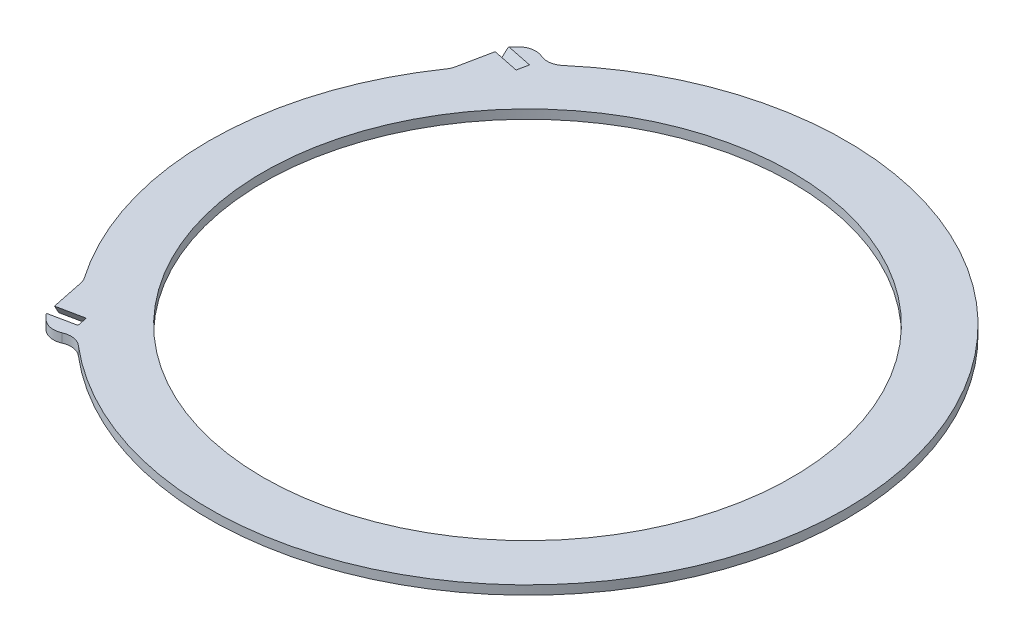
ISO-10303-21;
HEADER;
FILE_DESCRIPTION(('STEP AP214'),'2;1');
FILE_NAME('part.step','',(''),(''),'','','');
FILE_SCHEMA(('AUTOMOTIVE_DESIGN { 1 0 10303 214 1 1 1 1 }'));
ENDSEC;
DATA;
#1=APPLICATION_CONTEXT('core data for automotive mechanical design processes');
#2=APPLICATION_PROTOCOL_DEFINITION('international standard','automotive_design',2000,#1);
#3=PRODUCT_CONTEXT('',#1,'mechanical');
#4=PRODUCT('Part','Part','',(#3));
#5=PRODUCT_RELATED_PRODUCT_CATEGORY('part','',(#4));
#6=PRODUCT_DEFINITION_FORMATION('','',#4);
#7=PRODUCT_DEFINITION_CONTEXT('part definition',#1,'design');
#8=PRODUCT_DEFINITION('design','',#6,#7);
#9=PRODUCT_DEFINITION_SHAPE('','',#8);
#10=(LENGTH_UNIT() NAMED_UNIT(*) SI_UNIT(.MILLI.,.METRE.));
#11=(NAMED_UNIT(*) PLANE_ANGLE_UNIT() SI_UNIT($,.RADIAN.));
#12=(NAMED_UNIT(*) SI_UNIT($,.STERADIAN.) SOLID_ANGLE_UNIT());
#13=UNCERTAINTY_MEASURE_WITH_UNIT(LENGTH_MEASURE(1.E-05),#10,'distance_accuracy_value','');
#14=(GEOMETRIC_REPRESENTATION_CONTEXT(3) GLOBAL_UNCERTAINTY_ASSIGNED_CONTEXT((#13)) GLOBAL_UNIT_ASSIGNED_CONTEXT((#10,
#11,#12)) REPRESENTATION_CONTEXT('',''));
#15=CARTESIAN_POINT('',(0.,0.,0.));
#16=DIRECTION('',(0.,0.,1.));
#17=DIRECTION('',(1.,0.,0.));
#18=AXIS2_PLACEMENT_3D('',#15,#16,#17);
#19=CARTESIAN_POINT('',(0.,10.,0.));
#20=DIRECTION('',(0.,1.,0.));
#21=DIRECTION('',(0.,0.,1.));
#22=AXIS2_PLACEMENT_3D('',#19,#20,#21);
#23=PLANE('',#22);
#24=CARTESIAN_POINT('',(0.,10.,0.));
#25=DIRECTION('',(0.,1.,0.));
#26=DIRECTION('',(0.,0.,1.));
#27=AXIS2_PLACEMENT_3D('',#24,#25,#26);
#28=CIRCLE('',#27,295.);
#29=CARTESIAN_POINT('',(0.,10.,295.));
#30=VERTEX_POINT('',#29);
#31=EDGE_CURVE('E249',#30,#30,#28,.T.);
#32=ORIENTED_EDGE('',*,*,#31,.F.);
#33=EDGE_LOOP('',(#32));
#34=FACE_BOUND('',#33,.T.);
#35=CARTESIAN_POINT('',(0.,10.,0.));
#36=DIRECTION('',(0.,-1.,0.));
#37=DIRECTION('',(0.,0.,-1.));
#38=AXIS2_PLACEMENT_3D('',#35,#36,#37);
#39=CIRCLE('',#38,380.);
#40=CARTESIAN_POINT('',(-278.828900011322,10.,-258.175220574082));
#41=VERTEX_POINT('',#40);
#42=CARTESIAN_POINT('',(-274.342282872324,10.,-262.937847843178));
#43=VERTEX_POINT('',#42);
#44=EDGE_CURVE('E191',#41,#43,#39,.T.);
#45=ORIENTED_EDGE('',*,*,#44,.F.);
#46=DIRECTION('',(0.979540105481506,0.,0.201249054043192));
#47=VECTOR('',#46,1.);
#48=CARTESIAN_POINT('',(39.6015736039974,10.,-192.752854266674));
#49=LINE('',#48,#47);
#50=CARTESIAN_POINT('',(-250.00650002847,9.99999999999995,-252.253583778055));
#51=VERTEX_POINT('',#50);
#52=EDGE_CURVE('E315',#41,#51,#49,.T.);
#53=ORIENTED_EDGE('',*,*,#52,.T.);
#54=DIRECTION('',(0.201249054043193,0.,-0.979540105481506));
#55=VECTOR('',#54,1.);
#56=CARTESIAN_POINT('',(-289.608073632468,10.,-59.5007295113819));
#57=LINE('',#56,#55);
#58=CARTESIAN_POINT('',(-252.564496303329,10.,-239.803041077076));
#59=VERTEX_POINT('',#58);
#60=EDGE_CURVE('E183',#59,#51,#57,.T.);
#61=ORIENTED_EDGE('',*,*,#60,.F.);
#62=DIRECTION('',(0.979540105481506,0.,0.201249054043192));
#63=VECTOR('',#62,1.);
#64=CARTESIAN_POINT('',(37.0435773291386,10.,-180.302311565694));
#65=LINE('',#64,#63);
#66=CARTESIAN_POINT('',(-281.950699467774,10.0000000000001,-245.840512698371));
#67=VERTEX_POINT('',#66);
#68=EDGE_CURVE('E169',#67,#59,#65,.T.);
#69=ORIENTED_EDGE('',*,*,#68,.F.);
#70=DIRECTION('',(0.201249054043189,0.,-0.979540105481507));
#71=VECTOR('',#70,1.);
#72=CARTESIAN_POINT('',(-281.950699467775,10.,-245.84051269837));
#73=LINE('',#72,#71);
#74=CARTESIAN_POINT('',(-289.47071954455,10.,-209.238297128964));
#75=VERTEX_POINT('',#74);
#76=EDGE_CURVE('E181',#75,#67,#73,.T.);
#77=ORIENTED_EDGE('',*,*,#76,.F.);
#78=CARTESIAN_POINT('',(-309.061521654181,10.,-213.263278209828));
#79=DIRECTION('',(0.,1.,0.));
#80=DIRECTION('',(0.,0.,1.));
#81=AXIS2_PLACEMENT_3D('',#78,#79,#80);
#82=CIRCLE('',#81,20.);
#83=CARTESIAN_POINT('',(-292.600188942906,10.,-201.904381900383));
#84=VERTEX_POINT('',#83);
#85=EDGE_CURVE('E296',#75,#84,#82,.F.);
#86=ORIENTED_EDGE('',*,*,#85,.T.);
#87=CARTESIAN_POINT('',(0.,10.,0.));
#88=DIRECTION('',(0.,1.,0.));
#89=DIRECTION('',(0.,0.,1.));
#90=AXIS2_PLACEMENT_3D('',#87,#88,#89);
#91=CIRCLE('',#90,355.5);
#92=CARTESIAN_POINT('',(-292.600188942906,10.,201.904381900383));
#93=VERTEX_POINT('',#92);
#94=EDGE_CURVE('E259',#84,#93,#91,.T.);
#95=ORIENTED_EDGE('',*,*,#94,.T.);
#96=CARTESIAN_POINT('',(-309.061521654181,10.,213.263278209828));
#97=DIRECTION('',(0.,1.,0.));
#98=DIRECTION('',(0.,0.,1.));
#99=AXIS2_PLACEMENT_3D('',#96,#97,#98);
#100=CIRCLE('',#99,20.);
#101=CARTESIAN_POINT('',(-289.47071954455,10.,209.238297128964));
#102=VERTEX_POINT('',#101);
#103=EDGE_CURVE('E271',#93,#102,#100,.F.);
#104=ORIENTED_EDGE('',*,*,#103,.T.);
#105=DIRECTION('',(0.201249054043189,0.,0.979540105481507));
#106=VECTOR('',#105,1.);
#107=CARTESIAN_POINT('',(-279.584698805436,10.,257.356554596679));
#108=LINE('',#107,#106);
#109=CARTESIAN_POINT('',(-281.950699467775,10.,245.84051269837));
#110=VERTEX_POINT('',#109);
#111=EDGE_CURVE('E229',#102,#110,#108,.T.);
#112=ORIENTED_EDGE('',*,*,#111,.T.);
#113=DIRECTION('',(0.979540105481506,0.,-0.201249054043191));
#114=VECTOR('',#113,1.);
#115=CARTESIAN_POINT('',(37.0435773291383,10.,180.302311565693));
#116=LINE('',#115,#114);
#117=CARTESIAN_POINT('',(-252.564496303331,10.,239.803041077075));
#118=VERTEX_POINT('',#117);
#119=EDGE_CURVE('E219',#110,#118,#116,.T.);
#120=ORIENTED_EDGE('',*,*,#119,.T.);
#121=DIRECTION('',(-0.201249054043302,0.,-0.979540105481484));
#122=VECTOR('',#121,1.);
#123=CARTESIAN_POINT('',(-289.608073632483,10.,59.5007295114184));
#124=LINE('',#123,#122);
#125=CARTESIAN_POINT('',(-250.198495640991,9.99999999999866,251.319082975383));
#126=VERTEX_POINT('',#125);
#127=EDGE_CURVE('E222',#126,#118,#124,.T.);
#128=ORIENTED_EDGE('',*,*,#127,.F.);
#129=DIRECTION('',(-0.979540105481501,0.,0.201249054043218));
#130=VECTOR('',#129,1.);
#131=CARTESIAN_POINT('',(-250.198495640991,9.99999999999866,251.319082975383));
#132=LINE('',#131,#130);
#133=CARTESIAN_POINT('',(-279.584698805436,9.99999999999993,257.356554596679));
#134=VERTEX_POINT('',#133);
#135=EDGE_CURVE('E211',#126,#134,#132,.T.);
#136=ORIENTED_EDGE('',*,*,#135,.T.);
#137=CARTESIAN_POINT('',(0.,10.,0.));
#138=DIRECTION('',(0.,1.,0.));
#139=DIRECTION('',(0.,0.,1.));
#140=AXIS2_PLACEMENT_3D('',#137,#138,#139);
#141=CIRCLE('',#140,380.);
#142=CARTESIAN_POINT('',(-274.342282872324,10.,262.937847843178));
#143=VERTEX_POINT('',#142);
#144=EDGE_CURVE('E224',#134,#143,#141,.T.);
#145=ORIENTED_EDGE('',*,*,#144,.T.);
#146=CARTESIAN_POINT('',(-259.903215352728,10.,249.099013746168));
#147=DIRECTION('',(0.,1.,0.));
#148=DIRECTION('',(0.,0.,1.));
#149=AXIS2_PLACEMENT_3D('',#146,#147,#148);
#150=CIRCLE('',#149,19.9999999999999);
#151=CARTESIAN_POINT('',(-251.803676827684,10.,267.38555184613));
#152=VERTEX_POINT('',#151);
#153=EDGE_CURVE('E239',#143,#152,#150,.T.);
#154=ORIENTED_EDGE('',*,*,#153,.T.);
#155=CARTESIAN_POINT('',(-243.70413830264,10.,285.672089946091));
#156=DIRECTION('',(0.,1.,0.));
#157=DIRECTION('',(0.,0.,1.));
#158=AXIS2_PLACEMENT_3D('',#155,#156,#157);
#159=CIRCLE('',#158,20.);
#160=CARTESIAN_POINT('',(-230.723891255895,10.,270.456532558816));
#161=VERTEX_POINT('',#160);
#162=EDGE_CURVE('E278',#152,#161,#159,.F.);
#163=ORIENTED_EDGE('',*,*,#162,.T.);
#164=CARTESIAN_POINT('',(-230.723891255895,10.,-270.456532558816));
#165=VERTEX_POINT('',#164);
#166=EDGE_CURVE('E255',#161,#165,#91,.T.);
#167=ORIENTED_EDGE('',*,*,#166,.T.);
#168=CARTESIAN_POINT('',(-243.704138302641,10.,-285.672089946091));
#169=DIRECTION('',(0.,1.,0.));
#170=DIRECTION('',(0.,0.,1.));
#171=AXIS2_PLACEMENT_3D('',#168,#169,#170);
#172=CIRCLE('',#171,20.);
#173=CARTESIAN_POINT('',(-251.803676827684,10.,-267.38555184613));
#174=VERTEX_POINT('',#173);
#175=EDGE_CURVE('E175',#165,#174,#172,.F.);
#176=ORIENTED_EDGE('',*,*,#175,.T.);
#177=CARTESIAN_POINT('',(-259.903215352728,10.,-249.099013746168));
#178=DIRECTION('',(0.,-1.,0.));
#179=DIRECTION('',(0.,0.,-1.));
#180=AXIS2_PLACEMENT_3D('',#177,#178,#179);
#181=CIRCLE('',#180,19.9999999999999);
#182=EDGE_CURVE('E190',#43,#174,#181,.T.);
#183=ORIENTED_EDGE('',*,*,#182,.F.);
#184=EDGE_LOOP('',(#45,#53,#61,#69,#77,#86,#95,#104,#112,#120,#128,#136,#145,#154,#163,#167,
#176,#183));
#185=FACE_BOUND('',#184,.T.);
#186=ADVANCED_FACE('F33',(#34,#185),#23,.T.);
#187=CARTESIAN_POINT('',(0.,0.,0.));
#188=DIRECTION('',(0.,1.,0.));
#189=DIRECTION('',(0.,0.,1.));
#190=AXIS2_PLACEMENT_3D('',#187,#188,#189);
#191=PLANE('',#190);
#192=CARTESIAN_POINT('',(0.,0.,0.));
#193=DIRECTION('',(0.,1.,0.));
#194=DIRECTION('',(0.,0.,1.));
#195=AXIS2_PLACEMENT_3D('',#192,#193,#194);
#196=CIRCLE('',#195,295.);
#197=CARTESIAN_POINT('',(0.,0.,295.));
#198=VERTEX_POINT('',#197);
#199=EDGE_CURVE('E247',#198,#198,#196,.T.);
#200=ORIENTED_EDGE('',*,*,#199,.T.);
#201=EDGE_LOOP('',(#200));
#202=FACE_BOUND('',#201,.T.);
#203=DIRECTION('',(0.979540105481506,0.,0.201249054043192));
#204=VECTOR('',#203,1.);
#205=CARTESIAN_POINT('',(38.0225781110135,0.,-185.067404915839));
#206=LINE('',#205,#204);
#207=CARTESIAN_POINT('',(-280.9716986859,0.,-250.605606048516));
#208=VERTEX_POINT('',#207);
#209=CARTESIAN_POINT('',(-251.585495521454,0.,-244.568134427221));
#210=VERTEX_POINT('',#209);
#211=EDGE_CURVE('E306',#208,#210,#206,.T.);
#212=ORIENTED_EDGE('',*,*,#211,.F.);
#213=DIRECTION('',(0.201249054043189,0.,-0.979540105481507));
#214=VECTOR('',#213,1.);
#215=CARTESIAN_POINT('',(-279.584698805436,0.,-257.356554596679));
#216=LINE('',#215,#214);
#217=CARTESIAN_POINT('',(-279.584698805436,0.,-257.356554596679));
#218=VERTEX_POINT('',#217);
#219=EDGE_CURVE('E314',#208,#218,#216,.T.);
#220=ORIENTED_EDGE('',*,*,#219,.T.);
#221=CARTESIAN_POINT('',(0.,0.,0.));
#222=DIRECTION('',(0.,-1.,0.));
#223=DIRECTION('',(0.,0.,-1.));
#224=AXIS2_PLACEMENT_3D('',#221,#222,#223);
#225=CIRCLE('',#224,380.);
#226=CARTESIAN_POINT('',(-274.342282872324,0.,-262.937847843178));
#227=VERTEX_POINT('',#226);
#228=EDGE_CURVE('E194',#218,#227,#225,.T.);
#229=ORIENTED_EDGE('',*,*,#228,.T.);
#230=CARTESIAN_POINT('',(-259.903215352728,0.,-249.099013746168));
#231=DIRECTION('',(0.,-1.,0.));
#232=DIRECTION('',(0.,0.,-1.));
#233=AXIS2_PLACEMENT_3D('',#230,#231,#232);
#234=CIRCLE('',#233,19.9999999999999);
#235=CARTESIAN_POINT('',(-251.803676827684,0.,-267.38555184613));
#236=VERTEX_POINT('',#235);
#237=EDGE_CURVE('E206',#227,#236,#234,.T.);
#238=ORIENTED_EDGE('',*,*,#237,.T.);
#239=CARTESIAN_POINT('',(-243.704138302641,0.,-285.672089946091));
#240=DIRECTION('',(0.,1.,0.));
#241=DIRECTION('',(0.,0.,1.));
#242=AXIS2_PLACEMENT_3D('',#239,#240,#241);
#243=CIRCLE('',#242,20.);
#244=CARTESIAN_POINT('',(-230.723891255895,0.,-270.456532558816));
#245=VERTEX_POINT('',#244);
#246=EDGE_CURVE('E56',#236,#245,#243,.T.);
#247=ORIENTED_EDGE('',*,*,#246,.T.);
#248=CARTESIAN_POINT('',(0.,0.,0.));
#249=DIRECTION('',(0.,1.,0.));
#250=DIRECTION('',(0.,0.,1.));
#251=AXIS2_PLACEMENT_3D('',#248,#249,#250);
#252=CIRCLE('',#251,355.5);
#253=CARTESIAN_POINT('',(-230.723891255895,0.,270.456532558816));
#254=VERTEX_POINT('',#253);
#255=EDGE_CURVE('E260',#254,#245,#252,.T.);
#256=ORIENTED_EDGE('',*,*,#255,.F.);
#257=CARTESIAN_POINT('',(-243.70413830264,0.,285.672089946091));
#258=DIRECTION('',(0.,1.,0.));
#259=DIRECTION('',(0.,0.,1.));
#260=AXIS2_PLACEMENT_3D('',#257,#258,#259);
#261=CIRCLE('',#260,20.);
#262=CARTESIAN_POINT('',(-251.803676827684,0.,267.38555184613));
#263=VERTEX_POINT('',#262);
#264=EDGE_CURVE('E276',#254,#263,#261,.T.);
#265=ORIENTED_EDGE('',*,*,#264,.T.);
#266=CARTESIAN_POINT('',(-259.903215352728,0.,249.099013746168));
#267=DIRECTION('',(0.,1.,0.));
#268=DIRECTION('',(0.,0.,1.));
#269=AXIS2_PLACEMENT_3D('',#266,#267,#268);
#270=CIRCLE('',#269,19.9999999999999);
#271=CARTESIAN_POINT('',(-274.342282872324,0.,262.937847843178));
#272=VERTEX_POINT('',#271);
#273=EDGE_CURVE('E228',#272,#263,#270,.T.);
#274=ORIENTED_EDGE('',*,*,#273,.F.);
#275=CARTESIAN_POINT('',(0.,0.,0.));
#276=DIRECTION('',(0.,1.,0.));
#277=DIRECTION('',(0.,0.,1.));
#278=AXIS2_PLACEMENT_3D('',#275,#276,#277);
#279=CIRCLE('',#278,380.);
#280=CARTESIAN_POINT('',(-279.584698805436,0.,257.356554596679));
#281=VERTEX_POINT('',#280);
#282=EDGE_CURVE('E225',#281,#272,#279,.T.);
#283=ORIENTED_EDGE('',*,*,#282,.F.);
#284=DIRECTION('',(0.201249054043189,0.,0.979540105481507));
#285=VECTOR('',#284,1.);
#286=CARTESIAN_POINT('',(-281.950699467775,0.,245.84051269837));
#287=LINE('',#286,#285);
#288=CARTESIAN_POINT('',(-280.828821371287,0.,251.301033217067));
#289=VERTEX_POINT('',#288);
#290=EDGE_CURVE('E232',#289,#281,#287,.T.);
#291=ORIENTED_EDGE('',*,*,#290,.F.);
#292=DIRECTION('',(0.979540105481506,0.,-0.201249054043191));
#293=VECTOR('',#292,1.);
#294=CARTESIAN_POINT('',(38.1654554256262,0.,185.76283208439));
#295=LINE('',#294,#293);
#296=CARTESIAN_POINT('',(-251.442618206844,0.,245.263561595772));
#297=VERTEX_POINT('',#296);
#298=EDGE_CURVE('E210',#289,#297,#295,.T.);
#299=ORIENTED_EDGE('',*,*,#298,.T.);
#300=DIRECTION('',(-0.201249054043302,0.,-0.979540105481484));
#301=VECTOR('',#300,1.);
#302=CARTESIAN_POINT('',(-289.608073632484,0.,59.5007295114188));
#303=LINE('',#302,#301);
#304=CARTESIAN_POINT('',(-253.808618869184,0.,233.747519697463));
#305=VERTEX_POINT('',#304);
#306=EDGE_CURVE('E285',#297,#305,#303,.T.);
#307=ORIENTED_EDGE('',*,*,#306,.T.);
#308=DIRECTION('',(0.979540105481506,0.,-0.201249054043191));
#309=VECTOR('',#308,1.);
#310=CARTESIAN_POINT('',(35.7994547632876,0.,174.246790186081));
#311=LINE('',#310,#309);
#312=CARTESIAN_POINT('',(-283.194822033625,0.,239.784991318758));
#313=VERTEX_POINT('',#312);
#314=EDGE_CURVE('E217',#313,#305,#311,.T.);
#315=ORIENTED_EDGE('',*,*,#314,.F.);
#316=CARTESIAN_POINT('',(-289.47071954455,0.,209.238297128964));
#317=VERTEX_POINT('',#316);
#318=EDGE_CURVE('E233',#317,#313,#287,.T.);
#319=ORIENTED_EDGE('',*,*,#318,.F.);
#320=CARTESIAN_POINT('',(-309.061521654181,0.,213.263278209828));
#321=DIRECTION('',(0.,1.,0.));
#322=DIRECTION('',(0.,0.,1.));
#323=AXIS2_PLACEMENT_3D('',#320,#321,#322);
#324=CIRCLE('',#323,20.);
#325=CARTESIAN_POINT('',(-292.600188942906,0.,201.904381900383));
#326=VERTEX_POINT('',#325);
#327=EDGE_CURVE('E273',#317,#326,#324,.T.);
#328=ORIENTED_EDGE('',*,*,#327,.T.);
#329=CARTESIAN_POINT('',(-292.600188942906,0.,-201.904381900383));
#330=VERTEX_POINT('',#329);
#331=EDGE_CURVE('E252',#330,#326,#252,.T.);
#332=ORIENTED_EDGE('',*,*,#331,.F.);
#333=CARTESIAN_POINT('',(-309.061521654181,0.,-213.263278209828));
#334=DIRECTION('',(0.,1.,0.));
#335=DIRECTION('',(0.,0.,1.));
#336=AXIS2_PLACEMENT_3D('',#333,#334,#335);
#337=CIRCLE('',#336,20.);
#338=CARTESIAN_POINT('',(-289.47071954455,0.,-209.238297128964));
#339=VERTEX_POINT('',#338);
#340=EDGE_CURVE('E298',#330,#339,#337,.T.);
#341=ORIENTED_EDGE('',*,*,#340,.T.);
#342=CARTESIAN_POINT('',(-283.529694960759,0.,-238.155063347537));
#343=VERTEX_POINT('',#342);
#344=EDGE_CURVE('E319',#339,#343,#216,.T.);
#345=ORIENTED_EDGE('',*,*,#344,.T.);
#346=DIRECTION('',(0.979540105481506,0.,0.201249054043192));
#347=VECTOR('',#346,1.);
#348=CARTESIAN_POINT('',(35.4645818361547,0.,-172.61686221486));
#349=LINE('',#348,#347);
#350=CARTESIAN_POINT('',(-254.143491796313,0.,-232.117591726241));
#351=VERTEX_POINT('',#350);
#352=EDGE_CURVE('E48',#343,#351,#349,.T.);
#353=ORIENTED_EDGE('',*,*,#352,.T.);
#354=DIRECTION('',(0.201249054043193,0.,-0.979540105481506));
#355=VECTOR('',#354,1.);
#356=CARTESIAN_POINT('',(-289.608073632468,0.,-59.5007295113819));
#357=LINE('',#356,#355);
#358=EDGE_CURVE('E11',#351,#210,#357,.T.);
#359=ORIENTED_EDGE('',*,*,#358,.T.);
#360=EDGE_LOOP('',(#212,#220,#229,#238,#247,#256,#265,#274,#283,#291,#299,#307,#315,#319,#328,
#332,#341,#345,#353,#359));
#361=FACE_BOUND('',#360,.T.);
#362=ADVANCED_FACE('F312',(#202,#361),#191,.F.);
#363=CARTESIAN_POINT('',(0.,0.,0.));
#364=DIRECTION('',(0.,1.,0.));
#365=DIRECTION('',(0.,0.,1.));
#366=AXIS2_PLACEMENT_3D('',#363,#364,#365);
#367=CYLINDRICAL_SURFACE('',#366,380.);
#368=CARTESIAN_POINT('',(0.,-240.802321982309,0.));
#369=DIRECTION('',(-0.158331668233234,0.617278261310641,0.770648188830541));
#370=DIRECTION('',(0.124226666170193,0.786744906633218,-0.604648813195666));
#371=AXIS2_PLACEMENT_3D('',#368,#369,#370);
#372=ELLIPSE('',#371,615.605673838508,380.);
#373=CARTESIAN_POINT('',(-279.584698805436,8.78406484772398,-257.356554596679));
#374=VERTEX_POINT('',#373);
#375=EDGE_CURVE('E184',#41,#374,#372,.T.);
#376=ORIENTED_EDGE('',*,*,#375,.F.);
#377=ORIENTED_EDGE('',*,*,#44,.T.);
#378=DIRECTION('',(0.,1.,0.));
#379=VECTOR('',#378,1.);
#380=CARTESIAN_POINT('',(-274.342282872324,0.,-262.937847843178));
#381=LINE('',#380,#379);
#382=EDGE_CURVE('E199',#227,#43,#381,.T.);
#383=ORIENTED_EDGE('',*,*,#382,.F.);
#384=ORIENTED_EDGE('',*,*,#228,.F.);
#385=DIRECTION('',(0.,1.,0.));
#386=VECTOR('',#385,1.);
#387=CARTESIAN_POINT('',(-279.584698805436,0.,-257.356554596679));
#388=LINE('',#387,#386);
#389=EDGE_CURVE('E203',#218,#374,#388,.T.);
#390=ORIENTED_EDGE('',*,*,#389,.T.);
#391=EDGE_LOOP('',(#376,#377,#383,#384,#390));
#392=FACE_BOUND('',#391,.T.);
#393=ADVANCED_FACE('F397',(#392),#367,.T.);
#394=CARTESIAN_POINT('',(-281.950699467775,0.,-245.84051269837));
#395=DIRECTION('',(0.979540105481507,0.,0.201249054043189));
#396=DIRECTION('',(0.201249054043189,0.,-0.979540105481507));
#397=AXIS2_PLACEMENT_3D('',#394,#395,#396);
#398=PLANE('',#397);
#399=DIRECTION('',(-0.124226666170191,-0.786744906633219,0.604648813195667));
#400=VECTOR('',#399,1.);
#401=CARTESIAN_POINT('',(-281.344729754217,-2.36245809424024,-248.789950845841));
#402=LINE('',#401,#400);
#403=EDGE_CURVE('E41',#374,#208,#402,.T.);
#404=ORIENTED_EDGE('',*,*,#403,.F.);
#405=ORIENTED_EDGE('',*,*,#389,.F.);
#406=ORIENTED_EDGE('',*,*,#219,.F.);
#407=EDGE_LOOP('',(#404,#405,#406));
#408=FACE_BOUND('',#407,.T.);
#409=ADVANCED_FACE('F317',(#408),#398,.F.);
#410=CARTESIAN_POINT('',(0.,10.,0.));
#411=DIRECTION('',(0.,-1.,0.));
#412=DIRECTION('',(0.,0.,-1.));
#413=AXIS2_PLACEMENT_3D('',#410,#411,#412);
#414=CYLINDRICAL_SURFACE('',#413,355.5);
#415=ORIENTED_EDGE('',*,*,#255,.T.);
#416=DIRECTION('',(0.,-1.,0.));
#417=VECTOR('',#416,1.);
#418=CARTESIAN_POINT('',(-230.723891255895,10.,-270.456532558816));
#419=LINE('',#418,#417);
#420=EDGE_CURVE('E294',#245,#165,#419,.F.);
#421=ORIENTED_EDGE('',*,*,#420,.T.);
#422=ORIENTED_EDGE('',*,*,#166,.F.);
#423=DIRECTION('',(0.,-1.,0.));
#424=VECTOR('',#423,1.);
#425=CARTESIAN_POINT('',(-230.723891255895,10.,270.456532558816));
#426=LINE('',#425,#424);
#427=EDGE_CURVE('E258',#161,#254,#426,.T.);
#428=ORIENTED_EDGE('',*,*,#427,.T.);
#429=EDGE_LOOP('',(#415,#421,#422,#428));
#430=FACE_BOUND('',#429,.T.);
#431=ADVANCED_FACE('F333',(#430),#414,.T.);
#432=ORIENTED_EDGE('',*,*,#94,.F.);
#433=DIRECTION('',(0.,-1.,0.));
#434=VECTOR('',#433,1.);
#435=CARTESIAN_POINT('',(-292.600188942906,10.,-201.904381900383));
#436=LINE('',#435,#434);
#437=EDGE_CURVE('E289',#84,#330,#436,.T.);
#438=ORIENTED_EDGE('',*,*,#437,.T.);
#439=ORIENTED_EDGE('',*,*,#331,.T.);
#440=DIRECTION('',(0.,-1.,0.));
#441=VECTOR('',#440,1.);
#442=CARTESIAN_POINT('',(-292.600188942906,10.,201.904381900383));
#443=LINE('',#442,#441);
#444=EDGE_CURVE('E264',#326,#93,#443,.F.);
#445=ORIENTED_EDGE('',*,*,#444,.T.);
#446=EDGE_LOOP('',(#432,#438,#439,#445));
#447=FACE_BOUND('',#446,.T.);
#448=ADVANCED_FACE('F380',(#447),#414,.T.);
#449=CARTESIAN_POINT('',(-279.584698805436,0.,257.356554596679));
#450=DIRECTION('',(-0.979540105481507,0.,0.201249054043189));
#451=DIRECTION('',(0.201249054043189,0.,0.979540105481507));
#452=AXIS2_PLACEMENT_3D('',#449,#450,#451);
#453=PLANE('',#452);
#454=ORIENTED_EDGE('',*,*,#318,.T.);
#455=DIRECTION('',(0.105823507776939,0.850587479735828,0.515075066877088));
#456=VECTOR('',#455,1.);
#457=CARTESIAN_POINT('',(-282.196619569982,8.02334505491955,244.643545070365));
#458=LINE('',#457,#456);
#459=EDGE_CURVE('E282',#313,#110,#458,.T.);
#460=ORIENTED_EDGE('',*,*,#459,.T.);
#461=ORIENTED_EDGE('',*,*,#111,.F.);
#462=DIRECTION('',(0.,-1.,0.));
#463=VECTOR('',#462,1.);
#464=CARTESIAN_POINT('',(-289.47071954455,0.,209.238297128964));
#465=LINE('',#464,#463);
#466=EDGE_CURVE('E267',#102,#317,#465,.T.);
#467=ORIENTED_EDGE('',*,*,#466,.T.);
#468=EDGE_LOOP('',(#454,#460,#461,#467));
#469=FACE_BOUND('',#468,.T.);
#470=ADVANCED_FACE('F366',(#469),#453,.T.);
#471=CARTESIAN_POINT('',(0.,10.,0.));
#472=DIRECTION('',(0.,-1.,0.));
#473=DIRECTION('',(0.,0.,-1.));
#474=AXIS2_PLACEMENT_3D('',#471,#472,#473);
#475=CYLINDRICAL_SURFACE('',#474,295.);
#476=ORIENTED_EDGE('',*,*,#199,.F.);
#477=EDGE_LOOP('',(#476));
#478=FACE_BOUND('',#477,.T.);
#479=ORIENTED_EDGE('',*,*,#31,.T.);
#480=EDGE_LOOP('',(#479));
#481=FACE_BOUND('',#480,.T.);
#482=ADVANCED_FACE('F387',(#478,#481),#475,.F.);
#483=CARTESIAN_POINT('',(0.,0.,0.));
#484=DIRECTION('',(0.,1.,0.));
#485=DIRECTION('',(0.,0.,1.));
#486=AXIS2_PLACEMENT_3D('',#483,#484,#485);
#487=CYLINDRICAL_SURFACE('',#486,380.);
#488=ORIENTED_EDGE('',*,*,#144,.F.);
#489=DIRECTION('',(0.,1.,0.));
#490=VECTOR('',#489,1.);
#491=CARTESIAN_POINT('',(-279.584698805436,0.,257.356554596679));
#492=LINE('',#491,#490);
#493=EDGE_CURVE('E244',#281,#134,#492,.T.);
#494=ORIENTED_EDGE('',*,*,#493,.F.);
#495=ORIENTED_EDGE('',*,*,#282,.T.);
#496=DIRECTION('',(0.,1.,0.));
#497=VECTOR('',#496,1.);
#498=CARTESIAN_POINT('',(-274.342282872324,0.,262.937847843178));
#499=LINE('',#498,#497);
#500=EDGE_CURVE('E236',#272,#143,#499,.T.);
#501=ORIENTED_EDGE('',*,*,#500,.T.);
#502=EDGE_LOOP('',(#488,#494,#495,#501));
#503=FACE_BOUND('',#502,.T.);
#504=ADVANCED_FACE('F346',(#503),#487,.T.);
#505=DIRECTION('',(0.105823507776939,0.850587479735828,0.515075066877088));
#506=VECTOR('',#505,1.);
#507=CARTESIAN_POINT('',(-280.484820313204,2.76500939316637,252.975390566582));
#508=LINE('',#507,#506);
#509=EDGE_CURVE('E280',#289,#134,#508,.T.);
#510=ORIENTED_EDGE('',*,*,#509,.F.);
#511=ORIENTED_EDGE('',*,*,#290,.T.);
#512=ORIENTED_EDGE('',*,*,#493,.T.);
#513=EDGE_LOOP('',(#510,#511,#512));
#514=FACE_BOUND('',#513,.T.);
#515=ADVANCED_FACE('F351',(#514),#453,.T.);
#516=CARTESIAN_POINT('',(-259.903215352728,0.,249.099013746168));
#517=DIRECTION('',(0.,1.,0.));
#518=DIRECTION('',(0.,0.,1.));
#519=AXIS2_PLACEMENT_3D('',#516,#517,#518);
#520=CYLINDRICAL_SURFACE('',#519,19.9999999999999);
#521=ORIENTED_EDGE('',*,*,#273,.T.);
#522=DIRECTION('',(0.,1.,0.));
#523=VECTOR('',#522,1.);
#524=CARTESIAN_POINT('',(-251.803676827684,0.,267.38555184613));
#525=LINE('',#524,#523);
#526=EDGE_CURVE('E269',#263,#152,#525,.T.);
#527=ORIENTED_EDGE('',*,*,#526,.T.);
#528=ORIENTED_EDGE('',*,*,#153,.F.);
#529=ORIENTED_EDGE('',*,*,#500,.F.);
#530=EDGE_LOOP('',(#521,#527,#528,#529));
#531=FACE_BOUND('',#530,.T.);
#532=ADVANCED_FACE('F343',(#531),#520,.T.);
#533=CARTESIAN_POINT('',(-309.061521654181,10.,213.263278209828));
#534=DIRECTION('',(0.,-1.,0.));
#535=DIRECTION('',(0.,0.,-1.));
#536=AXIS2_PLACEMENT_3D('',#533,#534,#535);
#537=CYLINDRICAL_SURFACE('',#536,20.);
#538=ORIENTED_EDGE('',*,*,#327,.F.);
#539=ORIENTED_EDGE('',*,*,#466,.F.);
#540=ORIENTED_EDGE('',*,*,#103,.F.);
#541=ORIENTED_EDGE('',*,*,#444,.F.);
#542=EDGE_LOOP('',(#538,#539,#540,#541));
#543=FACE_BOUND('',#542,.T.);
#544=ADVANCED_FACE('F371',(#543),#537,.F.);
#545=CARTESIAN_POINT('',(-243.70413830264,0.,285.672089946091));
#546=DIRECTION('',(0.,1.,0.));
#547=DIRECTION('',(0.,0.,1.));
#548=AXIS2_PLACEMENT_3D('',#545,#546,#547);
#549=CYLINDRICAL_SURFACE('',#548,20.);
#550=ORIENTED_EDGE('',*,*,#162,.F.);
#551=ORIENTED_EDGE('',*,*,#526,.F.);
#552=ORIENTED_EDGE('',*,*,#264,.F.);
#553=ORIENTED_EDGE('',*,*,#427,.F.);
#554=EDGE_LOOP('',(#550,#551,#552,#553));
#555=FACE_BOUND('',#554,.T.);
#556=ADVANCED_FACE('F339',(#555),#549,.F.);
#557=CARTESIAN_POINT('',(-253.154417463623,5.25833566174585,236.931716099551));
#558=DIRECTION('',(0.979540105481484,-1.80703976088159E-13,-0.201249054043302));
#559=DIRECTION('',(-0.201249054043302,0.,-0.979540105481484));
#560=AXIS2_PLACEMENT_3D('',#557,#558,#559);
#561=PLANE('',#560);
#562=ORIENTED_EDGE('',*,*,#127,.T.);
#563=DIRECTION('',(0.105823507777147,0.850587479735828,0.515075066877045));
#564=VECTOR('',#563,1.);
#565=CARTESIAN_POINT('',(-253.154417463623,5.25833566174585,236.931716099551));
#566=LINE('',#565,#564);
#567=EDGE_CURVE('E207',#305,#118,#566,.T.);
#568=ORIENTED_EDGE('',*,*,#567,.F.);
#569=ORIENTED_EDGE('',*,*,#306,.F.);
#570=DIRECTION('',(0.105823507777149,0.850587479735829,0.515075066877044));
#571=VECTOR('',#570,1.);
#572=CARTESIAN_POINT('',(-251.442618206845,-7.31359417471822E-12,245.263561595767));
#573=LINE('',#572,#571);
#574=EDGE_CURVE('E202',#297,#126,#573,.T.);
#575=ORIENTED_EDGE('',*,*,#574,.T.);
#576=EDGE_LOOP('',(#562,#568,#569,#575));
#577=FACE_BOUND('',#576,.T.);
#578=ADVANCED_FACE('F359',(#577),#561,.F.);
#579=CARTESIAN_POINT('',(-250.198495640991,9.99999999999867,251.319082975383));
#580=DIRECTION('',(0.171179925677817,-0.525833566175318,0.833184549621682));
#581=DIRECTION('',(0.,-0.84566677340253,-0.533711259355613));
#582=AXIS2_PLACEMENT_3D('',#579,#580,#581);
#583=PLANE('',#582);
#584=ORIENTED_EDGE('',*,*,#509,.T.);
#585=ORIENTED_EDGE('',*,*,#135,.F.);
#586=ORIENTED_EDGE('',*,*,#574,.F.);
#587=ORIENTED_EDGE('',*,*,#298,.F.);
#588=EDGE_LOOP('',(#584,#585,#586,#587));
#589=FACE_BOUND('',#588,.T.);
#590=ADVANCED_FACE('F354',(#589),#583,.F.);
#591=CARTESIAN_POINT('',(-251.910294897769,15.2583356617518,242.987237479166));
#592=DIRECTION('',(0.171179925677817,-0.525833566175318,0.833184549621682));
#593=DIRECTION('',(0.,-0.84566677340253,-0.533711259355613));
#594=AXIS2_PLACEMENT_3D('',#591,#592,#593);
#595=PLANE('',#594);
#596=ORIENTED_EDGE('',*,*,#459,.F.);
#597=ORIENTED_EDGE('',*,*,#314,.T.);
#598=ORIENTED_EDGE('',*,*,#567,.T.);
#599=ORIENTED_EDGE('',*,*,#119,.F.);
#600=EDGE_LOOP('',(#596,#597,#598,#599));
#601=FACE_BOUND('',#600,.T.);
#602=ADVANCED_FACE('F361',(#601),#595,.T.);
#603=CARTESIAN_POINT('',(-259.903215352728,0.,-249.099013746168));
#604=DIRECTION('',(0.,1.,0.));
#605=DIRECTION('',(0.,0.,1.));
#606=AXIS2_PLACEMENT_3D('',#603,#604,#605);
#607=CYLINDRICAL_SURFACE('',#606,19.9999999999999);
#608=ORIENTED_EDGE('',*,*,#182,.T.);
#609=DIRECTION('',(0.,1.,0.));
#610=VECTOR('',#609,1.);
#611=CARTESIAN_POINT('',(-251.803676827684,0.,-267.38555184613));
#612=LINE('',#611,#610);
#613=EDGE_CURVE('E291',#174,#236,#612,.F.);
#614=ORIENTED_EDGE('',*,*,#613,.T.);
#615=ORIENTED_EDGE('',*,*,#237,.F.);
#616=ORIENTED_EDGE('',*,*,#382,.T.);
#617=EDGE_LOOP('',(#608,#614,#615,#616));
#618=FACE_BOUND('',#617,.T.);
#619=ADVANCED_FACE('F325',(#618),#607,.T.);
#620=ORIENTED_EDGE('',*,*,#76,.T.);
#621=DIRECTION('',(-0.124226666170191,-0.786744906633219,0.604648813195667));
#622=VECTOR('',#621,1.);
#623=CARTESIAN_POINT('',(-282.928046436549,3.81032451886611,-241.083468957536));
#624=LINE('',#623,#622);
#625=EDGE_CURVE('E166',#67,#343,#624,.T.);
#626=ORIENTED_EDGE('',*,*,#625,.T.);
#627=ORIENTED_EDGE('',*,*,#344,.F.);
#628=DIRECTION('',(0.,1.,0.));
#629=VECTOR('',#628,1.);
#630=CARTESIAN_POINT('',(-289.47071954455,10.,-209.238297128964));
#631=LINE('',#630,#629);
#632=EDGE_CURVE('E189',#339,#75,#631,.T.);
#633=ORIENTED_EDGE('',*,*,#632,.T.);
#634=EDGE_LOOP('',(#620,#626,#627,#633));
#635=FACE_BOUND('',#634,.T.);
#636=ADVANCED_FACE('F187',(#635),#398,.F.);
#637=CARTESIAN_POINT('',(-309.061521654181,10.,-213.263278209828));
#638=DIRECTION('',(0.,-1.,0.));
#639=DIRECTION('',(0.,0.,-1.));
#640=AXIS2_PLACEMENT_3D('',#637,#638,#639);
#641=CYLINDRICAL_SURFACE('',#640,20.);
#642=ORIENTED_EDGE('',*,*,#340,.F.);
#643=ORIENTED_EDGE('',*,*,#437,.F.);
#644=ORIENTED_EDGE('',*,*,#85,.F.);
#645=ORIENTED_EDGE('',*,*,#632,.F.);
#646=EDGE_LOOP('',(#642,#643,#644,#645));
#647=FACE_BOUND('',#646,.T.);
#648=ADVANCED_FACE('F378',(#647),#641,.F.);
#649=CARTESIAN_POINT('',(-243.704138302641,10.,-285.672089946091));
#650=DIRECTION('',(0.,1.,0.));
#651=DIRECTION('',(0.,0.,1.));
#652=AXIS2_PLACEMENT_3D('',#649,#650,#651);
#653=CYLINDRICAL_SURFACE('',#652,20.);
#654=ORIENTED_EDGE('',*,*,#175,.F.);
#655=ORIENTED_EDGE('',*,*,#420,.F.);
#656=ORIENTED_EDGE('',*,*,#246,.F.);
#657=ORIENTED_EDGE('',*,*,#613,.F.);
#658=EDGE_LOOP('',(#654,#655,#656,#657));
#659=FACE_BOUND('',#658,.T.);
#660=ADVANCED_FACE('F35',(#659),#653,.F.);
#661=CARTESIAN_POINT('',(-379.287425744109,-808.754241478705,376.9958415885));
#662=DIRECTION('',(0.979540105481506,0.,0.201249054043193));
#663=DIRECTION('',(0.201249054043193,0.,-0.979540105481506));
#664=AXIS2_PLACEMENT_3D('',#661,#662,#663);
#665=PLANE('',#664);
#666=ORIENTED_EDGE('',*,*,#60,.T.);
#667=DIRECTION('',(0.124226666170195,0.786744906633219,-0.604648813195666));
#668=VECTOR('',#667,1.);
#669=CARTESIAN_POINT('',(-379.287425744109,-808.754241478705,376.9958415885));
#670=LINE('',#669,#668);
#671=EDGE_CURVE('E614',#210,#51,#670,.T.);
#672=ORIENTED_EDGE('',*,*,#671,.F.);
#673=ORIENTED_EDGE('',*,*,#358,.F.);
#674=DIRECTION('',(0.124226666170195,0.786744906633219,-0.604648813195666));
#675=VECTOR('',#674,1.);
#676=CARTESIAN_POINT('',(-380.870742426441,-802.581458865599,384.702323476805));
#677=LINE('',#676,#675);
#678=EDGE_CURVE('E615',#351,#59,#677,.T.);
#679=ORIENTED_EDGE('',*,*,#678,.T.);
#680=EDGE_LOOP('',(#666,#672,#673,#679));
#681=FACE_BOUND('',#680,.T.);
#682=ADVANCED_FACE('F422',(#681),#665,.F.);
#683=CARTESIAN_POINT('',(565.335146841775,-808.754241478707,571.070997977638));
#684=DIRECTION('',(-0.158331668233234,0.617278261310641,0.770648188830541));
#685=DIRECTION('',(0.,-0.780493343789908,0.625164090699113));
#686=AXIS2_PLACEMENT_3D('',#683,#684,#685);
#687=PLANE('',#686);
#688=ORIENTED_EDGE('',*,*,#211,.T.);
#689=ORIENTED_EDGE('',*,*,#671,.T.);
#690=ORIENTED_EDGE('',*,*,#52,.F.);
#691=ORIENTED_EDGE('',*,*,#375,.T.);
#692=ORIENTED_EDGE('',*,*,#403,.T.);
#693=EDGE_LOOP('',(#688,#689,#690,#691,#692));
#694=FACE_BOUND('',#693,.T.);
#695=ADVANCED_FACE('F304',(#694),#687,.T.);
#696=CARTESIAN_POINT('',(563.751830159443,-802.5814588656,578.777479865944));
#697=DIRECTION('',(-0.158331668233234,0.617278261310641,0.770648188830541));
#698=DIRECTION('',(0.,-0.780493343789908,0.625164090699113));
#699=AXIS2_PLACEMENT_3D('',#696,#697,#698);
#700=PLANE('',#699);
#701=ORIENTED_EDGE('',*,*,#68,.T.);
#702=ORIENTED_EDGE('',*,*,#678,.F.);
#703=ORIENTED_EDGE('',*,*,#352,.F.);
#704=ORIENTED_EDGE('',*,*,#625,.F.);
#705=EDGE_LOOP('',(#701,#702,#703,#704));
#706=FACE_BOUND('',#705,.T.);
#707=ADVANCED_FACE('F168',(#706),#700,.F.);
#708=CLOSED_SHELL('',(#186,#362,#393,#409,#431,#448,#470,#482,#504,#515,#532,#544,#556,#578,
#590,#602,#619,#636,#648,#660,#682,#695,#707));
#709=MANIFOLD_SOLID_BREP('B2',#708);
#710=ADVANCED_BREP_SHAPE_REPRESENTATION('',(#18,#709),#14);
#711=SHAPE_DEFINITION_REPRESENTATION(#9,#710);
ENDSEC;
END-ISO-10303-21;
